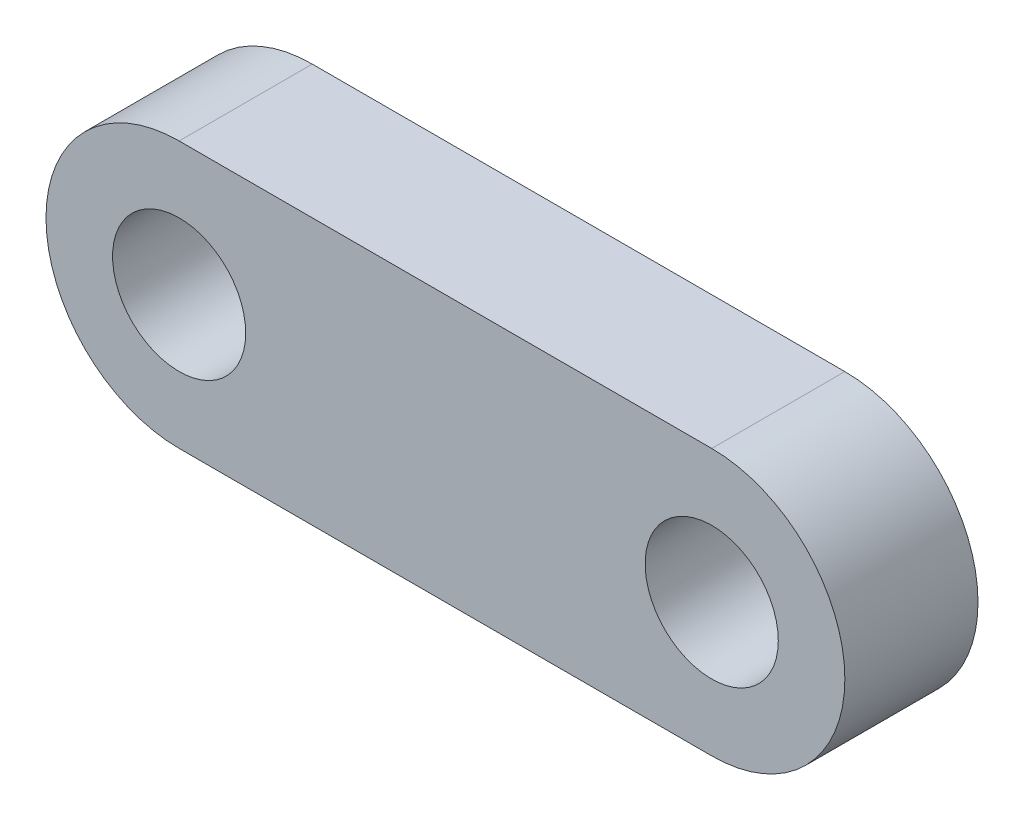
ISO-10303-21;
HEADER;
FILE_DESCRIPTION(('STEP AP214'),'2;1');
FILE_NAME('part.step','',(''),(''),'','','');
FILE_SCHEMA(('AUTOMOTIVE_DESIGN { 1 0 10303 214 1 1 1 1 }'));
ENDSEC;
DATA;
#1=APPLICATION_CONTEXT('core data for automotive mechanical design processes');
#2=APPLICATION_PROTOCOL_DEFINITION('international standard','automotive_design',2000,#1);
#3=PRODUCT_CONTEXT('',#1,'mechanical');
#4=PRODUCT('Part','Part','',(#3));
#5=PRODUCT_RELATED_PRODUCT_CATEGORY('part','',(#4));
#6=PRODUCT_DEFINITION_FORMATION('','',#4);
#7=PRODUCT_DEFINITION_CONTEXT('part definition',#1,'design');
#8=PRODUCT_DEFINITION('design','',#6,#7);
#9=PRODUCT_DEFINITION_SHAPE('','',#8);
#10=(LENGTH_UNIT() NAMED_UNIT(*) SI_UNIT(.MILLI.,.METRE.));
#11=(NAMED_UNIT(*) PLANE_ANGLE_UNIT() SI_UNIT($,.RADIAN.));
#12=(NAMED_UNIT(*) SI_UNIT($,.STERADIAN.) SOLID_ANGLE_UNIT());
#13=UNCERTAINTY_MEASURE_WITH_UNIT(LENGTH_MEASURE(1.E-05),#10,'distance_accuracy_value','');
#14=(GEOMETRIC_REPRESENTATION_CONTEXT(3) GLOBAL_UNCERTAINTY_ASSIGNED_CONTEXT((#13)) GLOBAL_UNIT_ASSIGNED_CONTEXT((#10,
#11,#12)) REPRESENTATION_CONTEXT('',''));
#15=CARTESIAN_POINT('',(0.,0.,0.));
#16=DIRECTION('',(0.,0.,1.));
#17=DIRECTION('',(1.,0.,0.));
#18=AXIS2_PLACEMENT_3D('',#15,#16,#17);
#19=CARTESIAN_POINT('',(-25.4,0.,-3.175));
#20=DIRECTION('',(0.,0.,-1.));
#21=DIRECTION('',(-1.,0.,0.));
#22=AXIS2_PLACEMENT_3D('',#19,#20,#21);
#23=PLANE('',#22);
#24=CARTESIAN_POINT('',(0.,0.,-3.175));
#25=DIRECTION('',(0.,0.,1.));
#26=DIRECTION('',(1.,0.,0.));
#27=AXIS2_PLACEMENT_3D('',#24,#25,#26);
#28=CIRCLE('',#27,3.175);
#29=CARTESIAN_POINT('',(3.175,0.,-3.175));
#30=VERTEX_POINT('',#29);
#31=EDGE_CURVE('E113',#30,#30,#28,.T.);
#32=ORIENTED_EDGE('',*,*,#31,.T.);
#33=EDGE_LOOP('',(#32));
#34=FACE_BOUND('',#33,.T.);
#35=CARTESIAN_POINT('',(-25.4,0.,-3.175));
#36=DIRECTION('',(0.,0.,1.));
#37=DIRECTION('',(-1.,0.,0.));
#38=AXIS2_PLACEMENT_3D('',#35,#36,#37);
#39=CIRCLE('',#38,6.35);
#40=CARTESIAN_POINT('',(-25.4,6.35,-3.175));
#41=VERTEX_POINT('',#40);
#42=CARTESIAN_POINT('',(-25.4,-6.35,-3.175));
#43=VERTEX_POINT('',#42);
#44=EDGE_CURVE('E97',#41,#43,#39,.T.);
#45=ORIENTED_EDGE('',*,*,#44,.F.);
#46=DIRECTION('',(-1.,0.,0.));
#47=VECTOR('',#46,1.);
#48=CARTESIAN_POINT('',(-25.4,6.35,-3.175));
#49=LINE('',#48,#47);
#50=CARTESIAN_POINT('',(0.,6.35,-3.175));
#51=VERTEX_POINT('',#50);
#52=EDGE_CURVE('E73',#51,#41,#49,.T.);
#53=ORIENTED_EDGE('',*,*,#52,.F.);
#54=CARTESIAN_POINT('',(0.,0.,-3.175));
#55=DIRECTION('',(0.,0.,1.));
#56=DIRECTION('',(-1.,0.,0.));
#57=AXIS2_PLACEMENT_3D('',#54,#55,#56);
#58=CIRCLE('',#57,6.35);
#59=CARTESIAN_POINT('',(0.,-6.35,-3.175));
#60=VERTEX_POINT('',#59);
#61=EDGE_CURVE('E67',#60,#51,#58,.T.);
#62=ORIENTED_EDGE('',*,*,#61,.F.);
#63=DIRECTION('',(1.,0.,0.));
#64=VECTOR('',#63,1.);
#65=CARTESIAN_POINT('',(0.,-6.35,-3.175));
#66=LINE('',#65,#64);
#67=EDGE_CURVE('E89',#43,#60,#66,.T.);
#68=ORIENTED_EDGE('',*,*,#67,.F.);
#69=EDGE_LOOP('',(#45,#53,#62,#68));
#70=FACE_BOUND('',#69,.T.);
#71=CARTESIAN_POINT('',(-25.4,0.,-3.175));
#72=DIRECTION('',(0.,0.,1.));
#73=DIRECTION('',(1.,0.,0.));
#74=AXIS2_PLACEMENT_3D('',#71,#72,#73);
#75=CIRCLE('',#74,3.175);
#76=CARTESIAN_POINT('',(-22.225,0.,-3.175));
#77=VERTEX_POINT('',#76);
#78=EDGE_CURVE('E119',#77,#77,#75,.T.);
#79=ORIENTED_EDGE('',*,*,#78,.T.);
#80=EDGE_LOOP('',(#79));
#81=FACE_BOUND('',#80,.T.);
#82=ADVANCED_FACE('F33',(#34,#70,#81),#23,.T.);
#83=CARTESIAN_POINT('',(-25.4,0.,3.175));
#84=DIRECTION('',(0.,0.,-1.));
#85=DIRECTION('',(-1.,0.,0.));
#86=AXIS2_PLACEMENT_3D('',#83,#84,#85);
#87=CYLINDRICAL_SURFACE('',#86,6.35);
#88=ORIENTED_EDGE('',*,*,#44,.T.);
#89=DIRECTION('',(0.,0.,-1.));
#90=VECTOR('',#89,1.);
#91=CARTESIAN_POINT('',(-25.4,-6.35,3.175));
#92=LINE('',#91,#90);
#93=CARTESIAN_POINT('',(-25.4,-6.35,3.175));
#94=VERTEX_POINT('',#93);
#95=EDGE_CURVE('E11',#94,#43,#92,.T.);
#96=ORIENTED_EDGE('',*,*,#95,.F.);
#97=CARTESIAN_POINT('',(-25.4,0.,3.175));
#98=DIRECTION('',(0.,0.,1.));
#99=DIRECTION('',(-1.,0.,0.));
#100=AXIS2_PLACEMENT_3D('',#97,#98,#99);
#101=CIRCLE('',#100,6.35);
#102=CARTESIAN_POINT('',(-25.4,6.35,3.175));
#103=VERTEX_POINT('',#102);
#104=EDGE_CURVE('E85',#103,#94,#101,.T.);
#105=ORIENTED_EDGE('',*,*,#104,.F.);
#106=DIRECTION('',(0.,0.,-1.));
#107=VECTOR('',#106,1.);
#108=CARTESIAN_POINT('',(-25.4,6.35,3.175));
#109=LINE('',#108,#107);
#110=EDGE_CURVE('E93',#103,#41,#109,.T.);
#111=ORIENTED_EDGE('',*,*,#110,.T.);
#112=EDGE_LOOP('',(#88,#96,#105,#111));
#113=FACE_BOUND('',#112,.T.);
#114=ADVANCED_FACE('F35',(#113),#87,.T.);
#115=CARTESIAN_POINT('',(0.,-6.35,3.175));
#116=DIRECTION('',(0.,1.,0.));
#117=DIRECTION('',(-1.,0.,0.));
#118=AXIS2_PLACEMENT_3D('',#115,#116,#117);
#119=PLANE('',#118);
#120=ORIENTED_EDGE('',*,*,#67,.T.);
#121=DIRECTION('',(0.,0.,-1.));
#122=VECTOR('',#121,1.);
#123=CARTESIAN_POINT('',(0.,-6.35,3.175));
#124=LINE('',#123,#122);
#125=CARTESIAN_POINT('',(0.,-6.35,3.175));
#126=VERTEX_POINT('',#125);
#127=EDGE_CURVE('E42',#126,#60,#124,.T.);
#128=ORIENTED_EDGE('',*,*,#127,.F.);
#129=DIRECTION('',(1.,0.,0.));
#130=VECTOR('',#129,1.);
#131=CARTESIAN_POINT('',(0.,-6.35,3.175));
#132=LINE('',#131,#130);
#133=EDGE_CURVE('E80',#94,#126,#132,.T.);
#134=ORIENTED_EDGE('',*,*,#133,.F.);
#135=ORIENTED_EDGE('',*,*,#95,.T.);
#136=EDGE_LOOP('',(#120,#128,#134,#135));
#137=FACE_BOUND('',#136,.T.);
#138=ADVANCED_FACE('F88',(#137),#119,.F.);
#139=CARTESIAN_POINT('',(0.,0.,3.175));
#140=DIRECTION('',(0.,0.,-1.));
#141=DIRECTION('',(-1.,0.,0.));
#142=AXIS2_PLACEMENT_3D('',#139,#140,#141);
#143=CYLINDRICAL_SURFACE('',#142,6.35);
#144=ORIENTED_EDGE('',*,*,#61,.T.);
#145=DIRECTION('',(0.,0.,-1.));
#146=VECTOR('',#145,1.);
#147=CARTESIAN_POINT('',(0.,6.35,3.175));
#148=LINE('',#147,#146);
#149=CARTESIAN_POINT('',(0.,6.35,3.175));
#150=VERTEX_POINT('',#149);
#151=EDGE_CURVE('E90',#150,#51,#148,.T.);
#152=ORIENTED_EDGE('',*,*,#151,.F.);
#153=CARTESIAN_POINT('',(0.,0.,3.175));
#154=DIRECTION('',(0.,0.,1.));
#155=DIRECTION('',(-1.,0.,0.));
#156=AXIS2_PLACEMENT_3D('',#153,#154,#155);
#157=CIRCLE('',#156,6.35);
#158=EDGE_CURVE('E83',#126,#150,#157,.T.);
#159=ORIENTED_EDGE('',*,*,#158,.F.);
#160=ORIENTED_EDGE('',*,*,#127,.T.);
#161=EDGE_LOOP('',(#144,#152,#159,#160));
#162=FACE_BOUND('',#161,.T.);
#163=ADVANCED_FACE('F91',(#162),#143,.T.);
#164=CARTESIAN_POINT('',(-25.4,6.35,3.175));
#165=DIRECTION('',(0.,-1.,0.));
#166=DIRECTION('',(1.,0.,0.));
#167=AXIS2_PLACEMENT_3D('',#164,#165,#166);
#168=PLANE('',#167);
#169=ORIENTED_EDGE('',*,*,#52,.T.);
#170=ORIENTED_EDGE('',*,*,#110,.F.);
#171=DIRECTION('',(-1.,0.,0.));
#172=VECTOR('',#171,1.);
#173=CARTESIAN_POINT('',(-25.4,6.35,3.175));
#174=LINE('',#173,#172);
#175=EDGE_CURVE('E50',#150,#103,#174,.T.);
#176=ORIENTED_EDGE('',*,*,#175,.F.);
#177=ORIENTED_EDGE('',*,*,#151,.T.);
#178=EDGE_LOOP('',(#169,#170,#176,#177));
#179=FACE_BOUND('',#178,.T.);
#180=ADVANCED_FACE('F105',(#179),#168,.F.);
#181=CARTESIAN_POINT('',(-25.4,0.,3.175));
#182=DIRECTION('',(0.,0.,-1.));
#183=DIRECTION('',(-1.,0.,0.));
#184=AXIS2_PLACEMENT_3D('',#181,#182,#183);
#185=PLANE('',#184);
#186=CARTESIAN_POINT('',(-25.4,0.,3.175));
#187=DIRECTION('',(0.,0.,1.));
#188=DIRECTION('',(1.,0.,0.));
#189=AXIS2_PLACEMENT_3D('',#186,#187,#188);
#190=CIRCLE('',#189,3.175);
#191=CARTESIAN_POINT('',(-22.225,0.,3.175));
#192=VERTEX_POINT('',#191);
#193=EDGE_CURVE('E116',#192,#192,#190,.T.);
#194=ORIENTED_EDGE('',*,*,#193,.F.);
#195=EDGE_LOOP('',(#194));
#196=FACE_BOUND('',#195,.T.);
#197=CARTESIAN_POINT('',(0.,0.,3.175));
#198=DIRECTION('',(0.,0.,1.));
#199=DIRECTION('',(1.,0.,0.));
#200=AXIS2_PLACEMENT_3D('',#197,#198,#199);
#201=CIRCLE('',#200,3.175);
#202=CARTESIAN_POINT('',(3.175,0.,3.175));
#203=VERTEX_POINT('',#202);
#204=EDGE_CURVE('E100',#203,#203,#201,.T.);
#205=ORIENTED_EDGE('',*,*,#204,.F.);
#206=EDGE_LOOP('',(#205));
#207=FACE_BOUND('',#206,.T.);
#208=ORIENTED_EDGE('',*,*,#104,.T.);
#209=ORIENTED_EDGE('',*,*,#133,.T.);
#210=ORIENTED_EDGE('',*,*,#158,.T.);
#211=ORIENTED_EDGE('',*,*,#175,.T.);
#212=EDGE_LOOP('',(#208,#209,#210,#211));
#213=FACE_BOUND('',#212,.T.);
#214=ADVANCED_FACE('F81',(#196,#207,#213),#185,.F.);
#215=CARTESIAN_POINT('',(0.,0.,3.175));
#216=DIRECTION('',(0.,0.,1.));
#217=DIRECTION('',(1.,0.,0.));
#218=AXIS2_PLACEMENT_3D('',#215,#216,#217);
#219=CYLINDRICAL_SURFACE('',#218,3.175);
#220=ORIENTED_EDGE('',*,*,#31,.F.);
#221=EDGE_LOOP('',(#220));
#222=FACE_BOUND('',#221,.T.);
#223=ORIENTED_EDGE('',*,*,#204,.T.);
#224=EDGE_LOOP('',(#223));
#225=FACE_BOUND('',#224,.T.);
#226=ADVANCED_FACE('F126',(#222,#225),#219,.F.);
#227=CARTESIAN_POINT('',(-25.4,0.,3.175));
#228=DIRECTION('',(0.,0.,1.));
#229=DIRECTION('',(1.,0.,0.));
#230=AXIS2_PLACEMENT_3D('',#227,#228,#229);
#231=CYLINDRICAL_SURFACE('',#230,3.175);
#232=ORIENTED_EDGE('',*,*,#78,.F.);
#233=EDGE_LOOP('',(#232));
#234=FACE_BOUND('',#233,.T.);
#235=ORIENTED_EDGE('',*,*,#193,.T.);
#236=EDGE_LOOP('',(#235));
#237=FACE_BOUND('',#236,.T.);
#238=ADVANCED_FACE('F123',(#234,#237),#231,.F.);
#239=CLOSED_SHELL('',(#82,#114,#138,#163,#180,#214,#226,#238));
#240=MANIFOLD_SOLID_BREP('B2',#239);
#241=ADVANCED_BREP_SHAPE_REPRESENTATION('',(#18,#240),#14);
#242=SHAPE_DEFINITION_REPRESENTATION(#9,#241);
ENDSEC;
END-ISO-10303-21;
